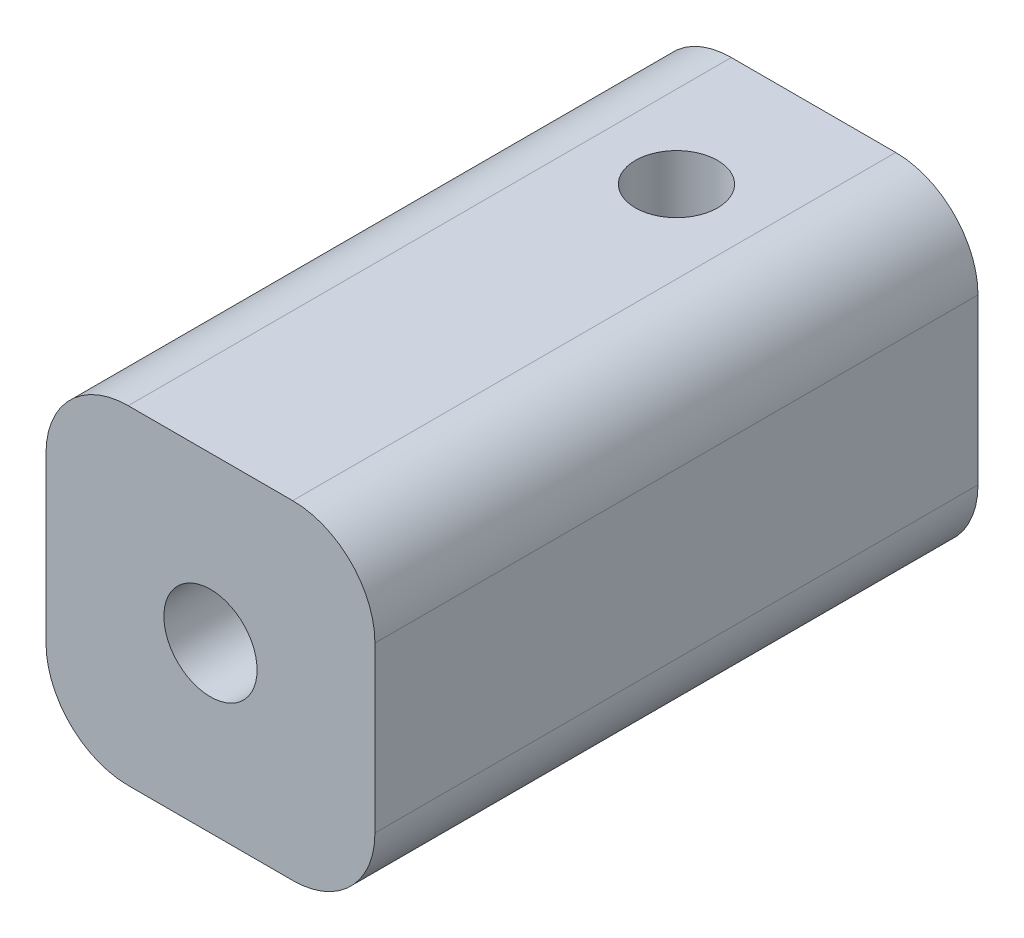
ISO-10303-21;
HEADER;
FILE_DESCRIPTION(('STEP AP214'),'2;1');
FILE_NAME('part.step','',(''),(''),'','','');
FILE_SCHEMA(('AUTOMOTIVE_DESIGN { 1 0 10303 214 1 1 1 1 }'));
ENDSEC;
DATA;
#1=APPLICATION_CONTEXT('core data for automotive mechanical design processes');
#2=APPLICATION_PROTOCOL_DEFINITION('international standard','automotive_design',2000,#1);
#3=PRODUCT_CONTEXT('',#1,'mechanical');
#4=PRODUCT('Part','Part','',(#3));
#5=PRODUCT_RELATED_PRODUCT_CATEGORY('part','',(#4));
#6=PRODUCT_DEFINITION_FORMATION('','',#4);
#7=PRODUCT_DEFINITION_CONTEXT('part definition',#1,'design');
#8=PRODUCT_DEFINITION('design','',#6,#7);
#9=PRODUCT_DEFINITION_SHAPE('','',#8);
#10=(LENGTH_UNIT() NAMED_UNIT(*) SI_UNIT(.MILLI.,.METRE.));
#11=(NAMED_UNIT(*) PLANE_ANGLE_UNIT() SI_UNIT($,.RADIAN.));
#12=(NAMED_UNIT(*) SI_UNIT($,.STERADIAN.) SOLID_ANGLE_UNIT());
#13=UNCERTAINTY_MEASURE_WITH_UNIT(LENGTH_MEASURE(1.E-05),#10,'distance_accuracy_value','');
#14=(GEOMETRIC_REPRESENTATION_CONTEXT(3) GLOBAL_UNCERTAINTY_ASSIGNED_CONTEXT((#13)) GLOBAL_UNIT_ASSIGNED_CONTEXT((#10,
#11,#12)) REPRESENTATION_CONTEXT('',''));
#15=CARTESIAN_POINT('',(0.,0.,0.));
#16=DIRECTION('',(0.,0.,1.));
#17=DIRECTION('',(1.,0.,0.));
#18=AXIS2_PLACEMENT_3D('',#15,#16,#17);
#19=CARTESIAN_POINT('',(0.,0.,22.));
#20=DIRECTION('',(0.,0.,1.));
#21=DIRECTION('',(1.,0.,0.));
#22=AXIS2_PLACEMENT_3D('',#19,#20,#21);
#23=PLANE('',#22);
#24=DIRECTION('',(0.,1.,0.));
#25=VECTOR('',#24,1.);
#26=CARTESIAN_POINT('',(19.4716981132076,5.20754716981132,22.));
#27=LINE('',#26,#25);
#28=CARTESIAN_POINT('',(19.4716981132076,-3.79245283018868,22.));
#29=VERTEX_POINT('',#28);
#30=CARTESIAN_POINT('',(19.4716981132076,2.20754716981132,22.));
#31=VERTEX_POINT('',#30);
#32=EDGE_CURVE('E228',#29,#31,#27,.T.);
#33=ORIENTED_EDGE('',*,*,#32,.T.);
#34=CARTESIAN_POINT('',(16.4716981132076,2.20754716981132,22.));
#35=DIRECTION('',(0.,0.,1.));
#36=DIRECTION('',(1.,0.,0.));
#37=AXIS2_PLACEMENT_3D('',#34,#35,#36);
#38=CIRCLE('',#37,3.);
#39=CARTESIAN_POINT('',(16.4716981132076,5.20754716981132,22.));
#40=VERTEX_POINT('',#39);
#41=EDGE_CURVE('E11',#31,#40,#38,.T.);
#42=ORIENTED_EDGE('',*,*,#41,.T.);
#43=DIRECTION('',(-1.,0.,0.));
#44=VECTOR('',#43,1.);
#45=CARTESIAN_POINT('',(7.47169811320756,5.20754716981132,22.));
#46=LINE('',#45,#44);
#47=CARTESIAN_POINT('',(10.4716981132076,5.20754716981132,22.));
#48=VERTEX_POINT('',#47);
#49=EDGE_CURVE('E116',#40,#48,#46,.T.);
#50=ORIENTED_EDGE('',*,*,#49,.T.);
#51=CARTESIAN_POINT('',(10.4716981132076,2.20754716981132,22.));
#52=DIRECTION('',(0.,0.,1.));
#53=DIRECTION('',(1.,0.,0.));
#54=AXIS2_PLACEMENT_3D('',#51,#52,#53);
#55=CIRCLE('',#54,3.);
#56=CARTESIAN_POINT('',(7.47169811320756,2.20754716981132,22.));
#57=VERTEX_POINT('',#56);
#58=EDGE_CURVE('E221',#48,#57,#55,.T.);
#59=ORIENTED_EDGE('',*,*,#58,.T.);
#60=DIRECTION('',(0.,-1.,0.));
#61=VECTOR('',#60,1.);
#62=CARTESIAN_POINT('',(7.47169811320756,5.20754716981132,22.));
#63=LINE('',#62,#61);
#64=CARTESIAN_POINT('',(7.47169811320756,-3.79245283018868,22.));
#65=VERTEX_POINT('',#64);
#66=EDGE_CURVE('E115',#57,#65,#63,.T.);
#67=ORIENTED_EDGE('',*,*,#66,.T.);
#68=CARTESIAN_POINT('',(10.4716981132076,-3.79245283018868,22.));
#69=DIRECTION('',(0.,0.,1.));
#70=DIRECTION('',(1.,0.,0.));
#71=AXIS2_PLACEMENT_3D('',#68,#69,#70);
#72=CIRCLE('',#71,3.);
#73=CARTESIAN_POINT('',(10.4716981132076,-6.79245283018868,22.));
#74=VERTEX_POINT('',#73);
#75=EDGE_CURVE('E213',#65,#74,#72,.T.);
#76=ORIENTED_EDGE('',*,*,#75,.T.);
#77=DIRECTION('',(1.,0.,0.));
#78=VECTOR('',#77,1.);
#79=CARTESIAN_POINT('',(7.47169811320756,-6.79245283018868,22.));
#80=LINE('',#79,#78);
#81=CARTESIAN_POINT('',(16.4716981132076,-6.79245283018868,22.));
#82=VERTEX_POINT('',#81);
#83=EDGE_CURVE('E229',#74,#82,#80,.T.);
#84=ORIENTED_EDGE('',*,*,#83,.T.);
#85=CARTESIAN_POINT('',(16.4716981132076,-3.79245283018868,22.));
#86=DIRECTION('',(0.,0.,1.));
#87=DIRECTION('',(1.,0.,0.));
#88=AXIS2_PLACEMENT_3D('',#85,#86,#87);
#89=CIRCLE('',#88,3.);
#90=EDGE_CURVE('E198',#82,#29,#89,.T.);
#91=ORIENTED_EDGE('',*,*,#90,.T.);
#92=EDGE_LOOP('',(#33,#42,#50,#59,#67,#76,#84,#91));
#93=FACE_BOUND('',#92,.T.);
#94=CARTESIAN_POINT('',(13.4716981132076,-0.792452830188677,22.));
#95=DIRECTION('',(0.,0.,1.));
#96=DIRECTION('',(1.,0.,0.));
#97=AXIS2_PLACEMENT_3D('',#94,#95,#96);
#98=CIRCLE('',#97,1.7);
#99=CARTESIAN_POINT('',(15.1716981132076,-0.792452830188677,22.));
#100=VERTEX_POINT('',#99);
#101=EDGE_CURVE('E123',#100,#100,#98,.T.);
#102=ORIENTED_EDGE('',*,*,#101,.F.);
#103=EDGE_LOOP('',(#102));
#104=FACE_BOUND('',#103,.T.);
#105=ADVANCED_FACE('F33',(#93,#104),#23,.T.);
#106=CARTESIAN_POINT('',(0.,0.,0.));
#107=DIRECTION('',(0.,0.,1.));
#108=DIRECTION('',(1.,0.,0.));
#109=AXIS2_PLACEMENT_3D('',#106,#107,#108);
#110=PLANE('',#109);
#111=DIRECTION('',(-1.,0.,0.));
#112=VECTOR('',#111,1.);
#113=CARTESIAN_POINT('',(7.47169811320756,5.20754716981132,0.));
#114=LINE('',#113,#112);
#115=CARTESIAN_POINT('',(16.4716981132076,5.20754716981132,0.));
#116=VERTEX_POINT('',#115);
#117=CARTESIAN_POINT('',(10.4716981132076,5.20754716981132,0.));
#118=VERTEX_POINT('',#117);
#119=EDGE_CURVE('E135',#116,#118,#114,.T.);
#120=ORIENTED_EDGE('',*,*,#119,.F.);
#121=CARTESIAN_POINT('',(16.4716981132076,2.20754716981132,0.));
#122=DIRECTION('',(0.,0.,1.));
#123=DIRECTION('',(1.,0.,0.));
#124=AXIS2_PLACEMENT_3D('',#121,#122,#123);
#125=CIRCLE('',#124,3.);
#126=CARTESIAN_POINT('',(19.4716981132076,2.20754716981132,0.));
#127=VERTEX_POINT('',#126);
#128=EDGE_CURVE('E55',#116,#127,#125,.F.);
#129=ORIENTED_EDGE('',*,*,#128,.T.);
#130=DIRECTION('',(0.,1.,0.));
#131=VECTOR('',#130,1.);
#132=CARTESIAN_POINT('',(19.4716981132076,5.20754716981132,0.));
#133=LINE('',#132,#131);
#134=CARTESIAN_POINT('',(19.4716981132076,-3.79245283018868,0.));
#135=VERTEX_POINT('',#134);
#136=EDGE_CURVE('E126',#135,#127,#133,.T.);
#137=ORIENTED_EDGE('',*,*,#136,.F.);
#138=CARTESIAN_POINT('',(16.4716981132076,-3.79245283018868,0.));
#139=DIRECTION('',(0.,0.,1.));
#140=DIRECTION('',(1.,0.,0.));
#141=AXIS2_PLACEMENT_3D('',#138,#139,#140);
#142=CIRCLE('',#141,3.);
#143=CARTESIAN_POINT('',(16.4716981132076,-6.79245283018868,0.));
#144=VERTEX_POINT('',#143);
#145=EDGE_CURVE('E207',#135,#144,#142,.F.);
#146=ORIENTED_EDGE('',*,*,#145,.T.);
#147=DIRECTION('',(1.,0.,0.));
#148=VECTOR('',#147,1.);
#149=CARTESIAN_POINT('',(7.47169811320756,-6.79245283018868,0.));
#150=LINE('',#149,#148);
#151=CARTESIAN_POINT('',(10.4716981132076,-6.79245283018868,0.));
#152=VERTEX_POINT('',#151);
#153=EDGE_CURVE('E122',#152,#144,#150,.T.);
#154=ORIENTED_EDGE('',*,*,#153,.F.);
#155=CARTESIAN_POINT('',(10.4716981132076,-3.79245283018868,0.));
#156=DIRECTION('',(0.,0.,1.));
#157=DIRECTION('',(1.,0.,0.));
#158=AXIS2_PLACEMENT_3D('',#155,#156,#157);
#159=CIRCLE('',#158,3.);
#160=CARTESIAN_POINT('',(7.47169811320756,-3.79245283018868,0.));
#161=VERTEX_POINT('',#160);
#162=EDGE_CURVE('E121',#152,#161,#159,.F.);
#163=ORIENTED_EDGE('',*,*,#162,.T.);
#164=DIRECTION('',(0.,-1.,0.));
#165=VECTOR('',#164,1.);
#166=CARTESIAN_POINT('',(7.47169811320756,5.20754716981132,0.));
#167=LINE('',#166,#165);
#168=CARTESIAN_POINT('',(7.47169811320756,2.20754716981132,0.));
#169=VERTEX_POINT('',#168);
#170=EDGE_CURVE('E112',#169,#161,#167,.T.);
#171=ORIENTED_EDGE('',*,*,#170,.F.);
#172=CARTESIAN_POINT('',(10.4716981132076,2.20754716981132,0.));
#173=DIRECTION('',(0.,0.,1.));
#174=DIRECTION('',(1.,0.,0.));
#175=AXIS2_PLACEMENT_3D('',#172,#173,#174);
#176=CIRCLE('',#175,3.);
#177=EDGE_CURVE('E99',#169,#118,#176,.F.);
#178=ORIENTED_EDGE('',*,*,#177,.T.);
#179=EDGE_LOOP('',(#120,#129,#137,#146,#154,#163,#171,#178));
#180=FACE_BOUND('',#179,.T.);
#181=CARTESIAN_POINT('',(13.4716981132076,-0.792452830188677,0.));
#182=DIRECTION('',(0.,0.,1.));
#183=DIRECTION('',(1.,0.,0.));
#184=AXIS2_PLACEMENT_3D('',#181,#182,#183);
#185=CIRCLE('',#184,1.7);
#186=CARTESIAN_POINT('',(15.1716981132076,-0.792452830188677,0.));
#187=VERTEX_POINT('',#186);
#188=EDGE_CURVE('E129',#187,#187,#185,.T.);
#189=ORIENTED_EDGE('',*,*,#188,.T.);
#190=EDGE_LOOP('',(#189));
#191=FACE_BOUND('',#190,.T.);
#192=ADVANCED_FACE('F118',(#180,#191),#110,.F.);
#193=CARTESIAN_POINT('',(7.47169811320756,5.20754716981132,22.));
#194=DIRECTION('',(1.,0.,0.));
#195=DIRECTION('',(0.,1.,0.));
#196=AXIS2_PLACEMENT_3D('',#193,#194,#195);
#197=PLANE('',#196);
#198=ORIENTED_EDGE('',*,*,#170,.T.);
#199=DIRECTION('',(0.,0.,-1.));
#200=VECTOR('',#199,1.);
#201=CARTESIAN_POINT('',(7.47169811320756,-3.79245283018868,22.));
#202=LINE('',#201,#200);
#203=EDGE_CURVE('E215',#161,#65,#202,.F.);
#204=ORIENTED_EDGE('',*,*,#203,.T.);
#205=ORIENTED_EDGE('',*,*,#66,.F.);
#206=DIRECTION('',(0.,0.,-1.));
#207=VECTOR('',#206,1.);
#208=CARTESIAN_POINT('',(7.47169811320756,2.20754716981132,22.));
#209=LINE('',#208,#207);
#210=EDGE_CURVE('E103',#57,#169,#209,.T.);
#211=ORIENTED_EDGE('',*,*,#210,.T.);
#212=EDGE_LOOP('',(#198,#204,#205,#211));
#213=FACE_BOUND('',#212,.T.);
#214=ADVANCED_FACE('F111',(#213),#197,.F.);
#215=CARTESIAN_POINT('',(7.47169811320756,-6.79245283018868,22.));
#216=DIRECTION('',(0.,1.,0.));
#217=DIRECTION('',(0.,0.,1.));
#218=AXIS2_PLACEMENT_3D('',#215,#216,#217);
#219=PLANE('',#218);
#220=CARTESIAN_POINT('',(13.4716981132076,-6.79245283018868,5.));
#221=DIRECTION('',(0.,1.,0.));
#222=DIRECTION('',(0.,0.,1.));
#223=AXIS2_PLACEMENT_3D('',#220,#221,#222);
#224=CIRCLE('',#223,1.5);
#225=CARTESIAN_POINT('',(13.4716981132076,-6.79245283018868,6.5));
#226=VERTEX_POINT('',#225);
#227=EDGE_CURVE('E234',#226,#226,#224,.T.);
#228=ORIENTED_EDGE('',*,*,#227,.T.);
#229=EDGE_LOOP('',(#228));
#230=FACE_BOUND('',#229,.T.);
#231=ORIENTED_EDGE('',*,*,#153,.T.);
#232=DIRECTION('',(0.,0.,-1.));
#233=VECTOR('',#232,1.);
#234=CARTESIAN_POINT('',(16.4716981132076,-6.79245283018868,22.));
#235=LINE('',#234,#233);
#236=EDGE_CURVE('E199',#144,#82,#235,.F.);
#237=ORIENTED_EDGE('',*,*,#236,.T.);
#238=ORIENTED_EDGE('',*,*,#83,.F.);
#239=DIRECTION('',(0.,0.,-1.));
#240=VECTOR('',#239,1.);
#241=CARTESIAN_POINT('',(10.4716981132076,-6.79245283018868,22.));
#242=LINE('',#241,#240);
#243=EDGE_CURVE('E218',#74,#152,#242,.T.);
#244=ORIENTED_EDGE('',*,*,#243,.T.);
#245=EDGE_LOOP('',(#231,#237,#238,#244));
#246=FACE_BOUND('',#245,.T.);
#247=ADVANCED_FACE('F180',(#230,#246),#219,.F.);
#248=CARTESIAN_POINT('',(19.4716981132076,5.20754716981132,22.));
#249=DIRECTION('',(-1.,0.,0.));
#250=DIRECTION('',(0.,0.,1.));
#251=AXIS2_PLACEMENT_3D('',#248,#249,#250);
#252=PLANE('',#251);
#253=ORIENTED_EDGE('',*,*,#136,.T.);
#254=DIRECTION('',(0.,0.,-1.));
#255=VECTOR('',#254,1.);
#256=CARTESIAN_POINT('',(19.4716981132076,2.20754716981132,22.));
#257=LINE('',#256,#255);
#258=EDGE_CURVE('E41',#127,#31,#257,.F.);
#259=ORIENTED_EDGE('',*,*,#258,.T.);
#260=ORIENTED_EDGE('',*,*,#32,.F.);
#261=DIRECTION('',(0.,0.,-1.));
#262=VECTOR('',#261,1.);
#263=CARTESIAN_POINT('',(19.4716981132076,-3.79245283018868,22.));
#264=LINE('',#263,#262);
#265=EDGE_CURVE('E201',#29,#135,#264,.T.);
#266=ORIENTED_EDGE('',*,*,#265,.T.);
#267=EDGE_LOOP('',(#253,#259,#260,#266));
#268=FACE_BOUND('',#267,.T.);
#269=ADVANCED_FACE('F176',(#268),#252,.F.);
#270=CARTESIAN_POINT('',(7.47169811320756,5.20754716981132,22.));
#271=DIRECTION('',(0.,-1.,0.));
#272=DIRECTION('',(0.,0.,-1.));
#273=AXIS2_PLACEMENT_3D('',#270,#271,#272);
#274=PLANE('',#273);
#275=CARTESIAN_POINT('',(13.4716981132076,5.20754716981132,5.));
#276=DIRECTION('',(0.,-1.,0.));
#277=DIRECTION('',(0.,0.,-1.));
#278=AXIS2_PLACEMENT_3D('',#275,#276,#277);
#279=CIRCLE('',#278,1.5);
#280=CARTESIAN_POINT('',(13.4716981132076,5.20754716981132,3.5));
#281=VERTEX_POINT('',#280);
#282=EDGE_CURVE('E238',#281,#281,#279,.T.);
#283=ORIENTED_EDGE('',*,*,#282,.T.);
#284=EDGE_LOOP('',(#283));
#285=FACE_BOUND('',#284,.T.);
#286=ORIENTED_EDGE('',*,*,#49,.F.);
#287=DIRECTION('',(0.,0.,-1.));
#288=VECTOR('',#287,1.);
#289=CARTESIAN_POINT('',(16.4716981132076,5.20754716981132,22.));
#290=LINE('',#289,#288);
#291=EDGE_CURVE('E203',#40,#116,#290,.T.);
#292=ORIENTED_EDGE('',*,*,#291,.T.);
#293=ORIENTED_EDGE('',*,*,#119,.T.);
#294=DIRECTION('',(0.,0.,-1.));
#295=VECTOR('',#294,1.);
#296=CARTESIAN_POINT('',(10.4716981132076,5.20754716981132,22.));
#297=LINE('',#296,#295);
#298=EDGE_CURVE('E105',#118,#48,#297,.F.);
#299=ORIENTED_EDGE('',*,*,#298,.T.);
#300=EDGE_LOOP('',(#286,#292,#293,#299));
#301=FACE_BOUND('',#300,.T.);
#302=ADVANCED_FACE('F173',(#285,#301),#274,.F.);
#303=CARTESIAN_POINT('',(13.4716981132076,-0.792452830188677,22.));
#304=DIRECTION('',(0.,0.,-1.));
#305=DIRECTION('',(-1.,0.,0.));
#306=AXIS2_PLACEMENT_3D('',#303,#304,#305);
#307=CYLINDRICAL_SURFACE('',#306,1.7);
#308=CARTESIAN_POINT('',(13.4716981132076,-2.49245283018868,6.5));
#309=CARTESIAN_POINT('',(13.5417068523817,-2.49245160382284,6.49999875632911));
#310=CARTESIAN_POINT('',(13.6117240091962,-2.48809234885185,6.49506353629652));
#311=CARTESIAN_POINT('',(13.7493916664549,-2.47105551877606,6.47571253606531));
#312=CARTESIAN_POINT('',(13.8170407901794,-2.4583731867337,6.46129133427649));
#313=CARTESIAN_POINT('',(13.9476580314437,-2.42584484929937,6.42409636130792));
#314=CARTESIAN_POINT('',(14.0106521463238,-2.40604293912569,6.4013739898979));
#315=CARTESIAN_POINT('',(14.1312879904491,-2.36060634738604,6.34880645897445));
#316=CARTESIAN_POINT('',(14.1889275120942,-2.33496927498646,6.31895837960802));
#317=CARTESIAN_POINT('',(14.3196731026762,-2.26833079677455,6.24048600251293));
#318=CARTESIAN_POINT('',(14.3900424262516,-2.22523697106201,6.1890791364719));
#319=CARTESIAN_POINT('',(14.5191759551605,-2.13375293395824,6.07709460275428));
#320=CARTESIAN_POINT('',(14.5779095699447,-2.08534926804836,6.0164934819822));
#321=CARTESIAN_POINT('',(14.6850976912884,-1.98539745635565,5.88598086187635));
#322=CARTESIAN_POINT('',(14.7332940807101,-1.93380328340412,5.8158920386535));
#323=CARTESIAN_POINT('',(14.7965762952045,-1.85818547468603,5.70463240529521));
#324=CARTESIAN_POINT('',(14.8161601835513,-1.83328803956798,5.66654694122864));
#325=CARTESIAN_POINT('',(14.8522697852715,-1.78488865994508,5.58812078557867));
#326=CARTESIAN_POINT('',(14.8687977297379,-1.76138570593483,5.54778176751936));
#327=CARTESIAN_POINT('',(14.898917936789,-1.71645945096385,5.46376184901165));
#328=CARTESIAN_POINT('',(14.9124469760411,-1.69508538320407,5.42003127289049));
#329=CARTESIAN_POINT('',(14.9357525759,-1.65677178716977,5.32971379216853));
#330=CARTESIAN_POINT('',(14.9455355185664,-1.63982473258823,5.28313190372115));
#331=CARTESIAN_POINT('',(14.9595334765371,-1.61496088787423,5.19494384550629));
#332=CARTESIAN_POINT('',(14.9643895533706,-1.60603215823256,5.15373665618565));
#333=CARTESIAN_POINT('',(14.9706359367736,-1.59447070834894,5.07021507091241));
#334=CARTESIAN_POINT('',(14.9720327786774,-1.59182611622936,5.02790291564666));
#335=CARTESIAN_POINT('',(14.9712260427683,-1.5933371509559,4.94338442721651));
#336=CARTESIAN_POINT('',(14.9690175662222,-1.59750203019522,4.90117831620491));
#337=CARTESIAN_POINT('',(14.9612156919552,-1.6118433897291,4.81810015365596));
#338=CARTESIAN_POINT('',(14.9556152542727,-1.6220323719033,4.77723106353436));
#339=CARTESIAN_POINT('',(14.9374714736663,-1.65384388950303,4.67518947427655));
#340=CARTESIAN_POINT('',(14.9227973362636,-1.67867390036954,4.61542856564467));
#341=CARTESIAN_POINT('',(14.8873918290115,-1.7342083165645,4.50054743905421));
#342=CARTESIAN_POINT('',(14.8666349693485,-1.76493725067712,4.44544803355374));
#343=CARTESIAN_POINT('',(14.8233893926452,-1.82398239010228,4.34785251950414));
#344=CARTESIAN_POINT('',(14.8017078110688,-1.8518991560425,4.30474962626569));
#345=CARTESIAN_POINT('',(14.7545709476081,-1.90851676333517,4.22119308912391));
#346=CARTESIAN_POINT('',(14.7291133376558,-1.93721807942475,4.1807411019496));
#347=CARTESIAN_POINT('',(14.6471455004012,-2.02312823852826,4.06328005061246));
#348=CARTESIAN_POINT('',(14.5849666802605,-2.08025045620948,3.99000137659436));
#349=CARTESIAN_POINT('',(14.4600071599469,-2.17742593711155,3.86901815082183));
#350=CARTESIAN_POINT('',(14.4001055321063,-2.21854184026076,3.81917669513383));
#351=CARTESIAN_POINT('',(14.270742550944,-2.29482932079735,3.72808806376743));
#352=CARTESIAN_POINT('',(14.2012990070396,-2.3300117064453,3.68682522897865));
#353=CARTESIAN_POINT('',(14.0683077013337,-2.38561574725722,3.62218341766973));
#354=CARTESIAN_POINT('',(14.0063474861163,-2.4075818965859,3.59687889007232));
#355=CARTESIAN_POINT('',(13.8777147346392,-2.44460818672002,3.55441131436544));
#356=CARTESIAN_POINT('',(13.81104499724,-2.45967239014345,3.53724347663843));
#357=CARTESIAN_POINT('',(13.6742435000289,-2.48177209411223,3.51210356533336));
#358=CARTESIAN_POINT('',(13.6040936353255,-2.48875970174551,3.50418634343732));
#359=CARTESIAN_POINT('',(13.4630607344038,-2.49389284823341,3.49836742260239));
#360=CARTESIAN_POINT('',(13.3921779394199,-2.49204120943077,3.50046252676047));
#361=CARTESIAN_POINT('',(13.2589194051943,-2.48028300732387,3.51380393336152));
#362=CARTESIAN_POINT('',(13.1963789664015,-2.47116466759814,3.52415481345262));
#363=CARTESIAN_POINT('',(13.0743091511263,-2.44652718476717,3.55224059608348));
#364=CARTESIAN_POINT('',(13.0147804713038,-2.43100656826114,3.56997719836013));
#365=CARTESIAN_POINT('',(12.8966832502851,-2.39351738268306,3.61308704826001));
#366=CARTESIAN_POINT('',(12.8383489006702,-2.37124030076038,3.63882764801381));
#367=CARTESIAN_POINT('',(12.7270147800305,-2.32188451310439,3.69639725694487));
#368=CARTESIAN_POINT('',(12.674016342775,-2.29480461150217,3.7282277826274));
#369=CARTESIAN_POINT('',(12.5478403608558,-2.22219645539291,3.81468440468026));
#370=CARTESIAN_POINT('',(12.4782709294899,-2.1743341868133,3.87262422850811));
#371=CARTESIAN_POINT('',(12.3517982476174,-2.07399949975199,3.9980920515021));
#372=CARTESIAN_POINT('',(12.2949512739735,-2.02150797623393,4.06566056876975));
#373=CARTESIAN_POINT('',(12.2186524133138,-1.94191973686999,4.17423647049404));
#374=CARTESIAN_POINT('',(12.1944929583613,-1.91493584994126,4.21210709985837));
#375=CARTESIAN_POINT('',(12.1494828304579,-1.86154764091626,4.29022357973887));
#376=CARTESIAN_POINT('',(12.1286344481035,-1.83514373083497,4.33047104837126));
#377=CARTESIAN_POINT('',(12.0904425144918,-1.78399018070203,4.41331058475652));
#378=CARTESIAN_POINT('',(12.0730830959125,-1.7592334104273,4.45589086291156));
#379=CARTESIAN_POINT('',(12.0419863923057,-1.71261895620732,4.54382524297806));
#380=CARTESIAN_POINT('',(12.0282429868391,-1.69075640510762,4.58917449569872));
#381=CARTESIAN_POINT('',(12.0062589012607,-1.65435980953767,4.67708758142461));
#382=CARTESIAN_POINT('',(11.99754399003,-1.63925028744669,4.71928629869572));
#383=CARTESIAN_POINT('',(11.983682053298,-1.61465141413093,4.80579490787401));
#384=CARTESIAN_POINT('',(11.9785238781479,-1.60514451356622,4.85009773270314));
#385=CARTESIAN_POINT('',(11.9721880358144,-1.59340322872894,4.94052064412547));
#386=CARTESIAN_POINT('',(11.9710560752906,-1.59125236259332,4.98665562233413));
#387=CARTESIAN_POINT('',(11.9730483716819,-1.59498050226204,5.07852745353656));
#388=CARTESIAN_POINT('',(11.9761772405469,-1.6008682090887,5.12426382111635));
#389=CARTESIAN_POINT('',(11.9872948628408,-1.62112439554374,5.22233122562971));
#390=CARTESIAN_POINT('',(11.9960938418639,-1.63689133510665,5.27426475520967));
#391=CARTESIAN_POINT('',(12.0183605921557,-1.6746584521294,5.3748115944622));
#392=CARTESIAN_POINT('',(12.0318459925729,-1.69668210787332,5.42341152543482));
#393=CARTESIAN_POINT('',(12.0612122771967,-1.74175589826124,5.51232484075526));
#394=CARTESIAN_POINT('',(12.0766796064369,-1.76444095812932,5.55296731425224));
#395=CARTESIAN_POINT('',(12.1106494893997,-1.81146796393036,5.63197739932792));
#396=CARTESIAN_POINT('',(12.1291543137685,-1.83581114134522,5.67034327962789));
#397=CARTESIAN_POINT('',(12.1891083502782,-1.9100358685172,5.78240938602268));
#398=CARTESIAN_POINT('',(12.2349783051273,-1.96108164984026,5.85302271254407));
#399=CARTESIAN_POINT('',(12.3420573337923,-2.06521056506994,5.9909869565072));
#400=CARTESIAN_POINT('',(12.4041184246175,-2.11818443773953,6.05775899935043));
#401=CARTESIAN_POINT('',(12.5419400352056,-2.21820119099918,6.18068735391677));
#402=CARTESIAN_POINT('',(12.6176628330357,-2.26525981209981,6.23687204666575));
#403=CARTESIAN_POINT('',(12.7578010928161,-2.3366551552924,6.32094198820479));
#404=CARTESIAN_POINT('',(12.8188345308826,-2.36357971689967,6.35226685817922));
#405=CARTESIAN_POINT('',(12.9467982461465,-2.41082014994477,6.40687672089125));
#406=CARTESIAN_POINT('',(13.0137221273223,-2.43114307981661,6.43017030229327));
#407=CARTESIAN_POINT('',(13.1451705159853,-2.4620255804914,6.46544794661415));
#408=CARTESIAN_POINT('',(13.2092709043495,-2.47335555720916,6.47832687379487));
#409=CARTESIAN_POINT('',(13.33947816833,-2.48856855554964,6.49560211448821));
#410=CARTESIAN_POINT('',(13.4055843872454,-2.4924539883243,6.50000117447789));
#411=CARTESIAN_POINT('',(13.4716981132076,-2.49245283018868,6.5));
#412=B_SPLINE_CURVE_WITH_KNOTS('',3,(#308,#309,#310,#311,#312,#313,#314,#315,#316,#317,#318,
#319,#320,#321,#322,#323,#324,#325,#326,#327,#328,#329,#330,#331,#332,#333,#334,#335,#336,#337,
#338,#339,#340,#341,#342,#343,#344,#345,#346,#347,#348,#349,#350,#351,#352,#353,#354,#355,#356,
#357,#358,#359,#360,#361,#362,#363,#364,#365,#366,#367,#368,#369,#370,#371,#372,#373,#374,#375,
#376,#377,#378,#379,#380,#381,#382,#383,#384,#385,#386,#387,#388,#389,#390,#391,#392,#393,#394,
#395,#396,#397,#398,#399,#400,#401,#402,#403,#404,#405,#406,#407,#408,#409,#410,#411),
.UNSPECIFIED.,.T.,.F.,(4,2,2,2,2,2,2,2,2,2,2,2,2,2,2,2,2,2,2,2,2,2,2,2,2,2,2,2,2,2,2,2,2,2,2,2,
2,2,2,2,2,2,2,2,2,2,2,2,2,2,2,4),(0.,0.209746025645155,0.419612033200701,0.628200011716771,
0.836873609063467,1.12694213140684,1.4177634154585,1.71506291983233,1.86355289337684,
2.0119340250927,2.16319585157903,2.31419882111561,2.44100184214456,2.56756511810675,
2.69430050532435,2.82129983553475,3.01924364988847,3.21802911341303,3.38504066109738,
3.55215560921966,3.88576342288103,4.14918146353635,4.41211436467847,4.62259354187402,
4.83294866730979,5.044544866971,5.25607350917081,5.44734857019671,5.63866767527278,
5.84054265762846,6.04246797620853,6.34805445353694,6.65496706692521,6.81204750386119,
6.96923613992702,7.12569286835261,7.28188305034769,7.41846366638829,7.5546141591455,
7.69230542118263,7.8301458396726,7.99416841662761,8.15881480671427,8.30575549755068,
8.45280653675967,8.74710503866704,9.06210498976215,9.37624813350882,9.59652516325777,
9.81656589263172,10.0147066524562,10.2127832272487),.UNSPECIFIED.);
#413=CARTESIAN_POINT('',(13.4716981132076,-2.49245283018868,6.5));
#414=VERTEX_POINT('',#413);
#415=EDGE_CURVE('E144',#414,#414,#412,.T.);
#416=ORIENTED_EDGE('',*,*,#415,.F.);
#417=EDGE_LOOP('',(#416));
#418=FACE_BOUND('',#417,.T.);
#419=CARTESIAN_POINT('',(13.4716981132076,0.907547169811322,6.5));
#420=CARTESIAN_POINT('',(13.4016893740334,0.907545943445485,6.49999875632912));
#421=CARTESIAN_POINT('',(13.3316722172189,0.903186688474496,6.49506353629652));
#422=CARTESIAN_POINT('',(13.1940045599602,0.886149858398707,6.47571253606531));
#423=CARTESIAN_POINT('',(13.1263554362357,0.873467526356341,6.46129133427649));
#424=CARTESIAN_POINT('',(12.9957381949714,0.840939188922016,6.42409636130792));
#425=CARTESIAN_POINT('',(12.9327440800913,0.821137278748339,6.4013739898979));
#426=CARTESIAN_POINT('',(12.812108235966,0.775700687008689,6.34880645897445));
#427=CARTESIAN_POINT('',(12.754468714321,0.750063614609101,6.31895837960802));
#428=CARTESIAN_POINT('',(12.6237231237389,0.683425136397198,6.24048600251293));
#429=CARTESIAN_POINT('',(12.5533538001635,0.640331310684653,6.1890791364719));
#430=CARTESIAN_POINT('',(12.4242202712546,0.548847273580885,6.07709460275428));
#431=CARTESIAN_POINT('',(12.3654866564704,0.500443607671008,6.0164934819822));
#432=CARTESIAN_POINT('',(12.2582985351267,0.400491795978294,5.88598086187635));
#433=CARTESIAN_POINT('',(12.210102145705,0.348897623026763,5.8158920386535));
#434=CARTESIAN_POINT('',(12.1468199312106,0.273279814308675,5.70463240529522));
#435=CARTESIAN_POINT('',(12.1272360428638,0.248382379190624,5.66654694122864));
#436=CARTESIAN_POINT('',(12.0911264411436,0.199982999567728,5.58812078557867));
#437=CARTESIAN_POINT('',(12.0745984966772,0.176480045557479,5.54778176751936));
#438=CARTESIAN_POINT('',(12.0444782896261,0.131553790586491,5.46376184901165));
#439=CARTESIAN_POINT('',(12.030949250374,0.110179722826718,5.42003127289049));
#440=CARTESIAN_POINT('',(12.0076436505151,0.0718661267924166,5.32971379216853));
#441=CARTESIAN_POINT('',(11.9978607078487,0.054919072210879,5.28313190372115));
#442=CARTESIAN_POINT('',(11.9838627498781,0.0300552274968779,5.19494384550629));
#443=CARTESIAN_POINT('',(11.9790066730445,0.0211264978552085,5.15373665618565));
#444=CARTESIAN_POINT('',(11.9727602896416,0.00956504797158851,5.07021507091241));
#445=CARTESIAN_POINT('',(11.9713634477377,0.00692045585200277,5.02790291564666));
#446=CARTESIAN_POINT('',(11.9721701836468,0.00843149057854573,4.94338442721652));
#447=CARTESIAN_POINT('',(11.9743786601929,0.0125963698178692,4.90117831620491));
#448=CARTESIAN_POINT('',(11.9821805344599,0.0269377293517454,4.81810015365597));
#449=CARTESIAN_POINT('',(11.9877809721424,0.0371267115259417,4.77723106353436));
#450=CARTESIAN_POINT('',(12.0059247527488,0.0689382291256747,4.67518947427656));
#451=CARTESIAN_POINT('',(12.0205988901515,0.0937682399921787,4.61542856564467));
#452=CARTESIAN_POINT('',(12.0560043974036,0.149302656187145,4.50054743905421));
#453=CARTESIAN_POINT('',(12.0767612570666,0.180031590299763,4.44544803355375));
#454=CARTESIAN_POINT('',(12.1200068337699,0.239076729724926,4.34785251950415));
#455=CARTESIAN_POINT('',(12.1416884153463,0.266993495665139,4.30474962626569));
#456=CARTESIAN_POINT('',(12.188825278807,0.323611102957811,4.22119308912391));
#457=CARTESIAN_POINT('',(12.2142828887593,0.352312419047391,4.18074110194961));
#458=CARTESIAN_POINT('',(12.2962507260139,0.438222578150903,4.06328005061246));
#459=CARTESIAN_POINT('',(12.3584295461546,0.495344795832122,3.99000137659436));
#460=CARTESIAN_POINT('',(12.4833890664682,0.592520276734191,3.86901815082183));
#461=CARTESIAN_POINT('',(12.5432906943088,0.6336361798834,3.81917669513384));
#462=CARTESIAN_POINT('',(12.6726536754711,0.709923660419996,3.72808806376744));
#463=CARTESIAN_POINT('',(12.7420972193755,0.745106046067945,3.68682522897865));
#464=CARTESIAN_POINT('',(12.8750885250814,0.800710086879864,3.62218341766973));
#465=CARTESIAN_POINT('',(12.9370487402988,0.822676236208549,3.59687889007233));
#466=CARTESIAN_POINT('',(13.0656814917759,0.859702526342669,3.55441131436544));
#467=CARTESIAN_POINT('',(13.1323512291751,0.874766729766092,3.53724347663843));
#468=CARTESIAN_POINT('',(13.2691527263863,0.896866433734873,3.51210356533336));
#469=CARTESIAN_POINT('',(13.3393025910896,0.90385404136816,3.50418634343732));
#470=CARTESIAN_POINT('',(13.4803354920113,0.908987187856053,3.49836742260239));
#471=CARTESIAN_POINT('',(13.5512182869952,0.907135549053415,3.50046252676047));
#472=CARTESIAN_POINT('',(13.6844768212208,0.895377346946518,3.51380393336152));
#473=CARTESIAN_POINT('',(13.7470172600136,0.886259007220782,3.52415481345262));
#474=CARTESIAN_POINT('',(13.8690870752888,0.861621524389816,3.55224059608348));
#475=CARTESIAN_POINT('',(13.9286157551113,0.846100907883783,3.56997719836013));
#476=CARTESIAN_POINT('',(14.04671297613,0.808611722305702,3.61308704826001));
#477=CARTESIAN_POINT('',(14.1050473257449,0.786334640383025,3.6388276480138));
#478=CARTESIAN_POINT('',(14.2163814463847,0.736978852727033,3.69639725694487));
#479=CARTESIAN_POINT('',(14.2693798836401,0.709898951124816,3.7282277826274));
#480=CARTESIAN_POINT('',(14.3955558655593,0.637290795015562,3.81468440468026));
#481=CARTESIAN_POINT('',(14.4651252969252,0.58942852643595,3.8726242285081));
#482=CARTESIAN_POINT('',(14.5915979787977,0.489093839374636,3.9980920515021));
#483=CARTESIAN_POINT('',(14.6484449524416,0.436602315856581,4.06566056876974));
#484=CARTESIAN_POINT('',(14.7247438131014,0.357014076492642,4.17423647049404));
#485=CARTESIAN_POINT('',(14.7489032680538,0.330030189563912,4.21210709985836));
#486=CARTESIAN_POINT('',(14.7939133959572,0.276641980538908,4.29022357973887));
#487=CARTESIAN_POINT('',(14.8147617783116,0.250238070457617,4.33047104837125));
#488=CARTESIAN_POINT('',(14.8529537119233,0.199084520324677,4.41331058475651));
#489=CARTESIAN_POINT('',(14.8703131305026,0.174327750049947,4.45589086291156));
#490=CARTESIAN_POINT('',(14.9014098341094,0.127713295829973,4.54382524297805));
#491=CARTESIAN_POINT('',(14.915153239576,0.105850744730269,4.58917449569872));
#492=CARTESIAN_POINT('',(14.9371373251544,0.0694541491603227,4.6770875814246));
#493=CARTESIAN_POINT('',(14.9458522363851,0.0543446270693424,4.71928629869571));
#494=CARTESIAN_POINT('',(14.9597141731171,0.0297457537535783,4.80579490787401));
#495=CARTESIAN_POINT('',(14.9648723482672,0.0202388531888673,4.85009773270313));
#496=CARTESIAN_POINT('',(14.9712081906007,0.00849756835159014,4.94052064412546));
#497=CARTESIAN_POINT('',(14.9723401511245,0.00634670221596684,4.98665562233412));
#498=CARTESIAN_POINT('',(14.9703478547332,0.0100748418846819,5.07852745353656));
#499=CARTESIAN_POINT('',(14.9672189858682,0.0159625487113411,5.12426382111634));
#500=CARTESIAN_POINT('',(14.9561013635743,0.0362187351663817,5.22233122562971));
#501=CARTESIAN_POINT('',(14.9473023845512,0.051985674729296,5.27426475520967));
#502=CARTESIAN_POINT('',(14.9250356342594,0.0897527917520395,5.3748115944622));
#503=CARTESIAN_POINT('',(14.9115502338422,0.111776447495965,5.42341152543481));
#504=CARTESIAN_POINT('',(14.8821839492184,0.156850237883883,5.51232484075526));
#505=CARTESIAN_POINT('',(14.8667166199782,0.179535297751964,5.55296731425224));
#506=CARTESIAN_POINT('',(14.8327467370154,0.226562303552999,5.63197739932792));
#507=CARTESIAN_POINT('',(14.8142419126466,0.250905480967861,5.67034327962789));
#508=CARTESIAN_POINT('',(14.7542878761369,0.325130208139843,5.78240938602267));
#509=CARTESIAN_POINT('',(14.7084179212878,0.376175989462899,5.85302271254406));
#510=CARTESIAN_POINT('',(14.6013388926229,0.480304904692583,5.99098695650719));
#511=CARTESIAN_POINT('',(14.5392778017977,0.533278777362174,6.05775899935042));
#512=CARTESIAN_POINT('',(14.4014561912095,0.63329553062182,6.18068735391676));
#513=CARTESIAN_POINT('',(14.3257333933794,0.680354151722453,6.23687204666574));
#514=CARTESIAN_POINT('',(14.185595133599,0.751749494915039,6.32094198820479));
#515=CARTESIAN_POINT('',(14.1245616955325,0.778674056522313,6.35226685817921));
#516=CARTESIAN_POINT('',(13.9965979802687,0.825914489567417,6.40687672089124));
#517=CARTESIAN_POINT('',(13.9296740990928,0.846237419439251,6.43017030229326));
#518=CARTESIAN_POINT('',(13.7982257104298,0.877119920114041,6.46544794661415));
#519=CARTESIAN_POINT('',(13.7341253220657,0.888449896831802,6.47832687379487));
#520=CARTESIAN_POINT('',(13.6039180580852,0.903662895172282,6.49560211448821));
#521=CARTESIAN_POINT('',(13.5378118391697,0.907548327946948,6.50000117447789));
#522=CARTESIAN_POINT('',(13.4716981132076,0.907547169811322,6.5));
#523=B_SPLINE_CURVE_WITH_KNOTS('',3,(#419,#420,#421,#422,#423,#424,#425,#426,#427,#428,#429,
#430,#431,#432,#433,#434,#435,#436,#437,#438,#439,#440,#441,#442,#443,#444,#445,#446,#447,#448,
#449,#450,#451,#452,#453,#454,#455,#456,#457,#458,#459,#460,#461,#462,#463,#464,#465,#466,#467,
#468,#469,#470,#471,#472,#473,#474,#475,#476,#477,#478,#479,#480,#481,#482,#483,#484,#485,#486,
#487,#488,#489,#490,#491,#492,#493,#494,#495,#496,#497,#498,#499,#500,#501,#502,#503,#504,#505,
#506,#507,#508,#509,#510,#511,#512,#513,#514,#515,#516,#517,#518,#519,#520,#521,#522),
.UNSPECIFIED.,.T.,.F.,(4,2,2,2,2,2,2,2,2,2,2,2,2,2,2,2,2,2,2,2,2,2,2,2,2,2,2,2,2,2,2,2,2,2,2,2,
2,2,2,2,2,2,2,2,2,2,2,2,2,2,2,4),(0.,0.209746025645155,0.419612033200701,0.628200011716771,
0.836873609063468,1.12694213140684,1.4177634154585,1.71506291983233,1.86355289337683,
2.0119340250927,2.16319585157903,2.31419882111561,2.44100184214455,2.56756511810674,
2.69430050532435,2.82129983553475,3.01924364988847,3.21802911341302,3.38504066109738,
3.55215560921965,3.88576342288102,4.14918146353634,4.41211436467847,4.62259354187402,
4.83294866730979,5.044544866971,5.25607350917081,5.44734857019671,5.63866767527277,
5.84054265762846,6.04246797620853,6.34805445353693,6.6549670669252,6.81204750386119,
6.96923613992701,7.1256928683526,7.28188305034768,7.41846366638829,7.5546141591455,
7.69230542118263,7.8301458396726,7.9941684166276,8.15881480671426,8.30575549755068,
8.45280653675966,8.74710503866704,9.06210498976214,9.3762481335088,9.59652516325776,
9.81656589263171,10.0147066524562,10.2127832272487),.UNSPECIFIED.);
#524=CARTESIAN_POINT('',(13.4716981132076,0.907547169811322,6.5));
#525=VERTEX_POINT('',#524);
#526=EDGE_CURVE('E137',#525,#525,#523,.T.);
#527=ORIENTED_EDGE('',*,*,#526,.F.);
#528=EDGE_LOOP('',(#527));
#529=FACE_BOUND('',#528,.T.);
#530=ORIENTED_EDGE('',*,*,#101,.T.);
#531=EDGE_LOOP('',(#530));
#532=FACE_BOUND('',#531,.T.);
#533=ORIENTED_EDGE('',*,*,#188,.F.);
#534=EDGE_LOOP('',(#533));
#535=FACE_BOUND('',#534,.T.);
#536=ADVANCED_FACE('F147',(#418,#529,#532,#535),#307,.F.);
#537=CARTESIAN_POINT('',(13.4716981132076,-10.,5.));
#538=DIRECTION('',(0.,1.,0.));
#539=DIRECTION('',(0.,0.,1.));
#540=AXIS2_PLACEMENT_3D('',#537,#538,#539);
#541=CYLINDRICAL_SURFACE('',#540,1.5);
#542=ORIENTED_EDGE('',*,*,#526,.T.);
#543=EDGE_LOOP('',(#542));
#544=FACE_BOUND('',#543,.T.);
#545=ORIENTED_EDGE('',*,*,#282,.F.);
#546=EDGE_LOOP('',(#545));
#547=FACE_BOUND('',#546,.T.);
#548=ADVANCED_FACE('F153',(#544,#547),#541,.F.);
#549=ORIENTED_EDGE('',*,*,#415,.T.);
#550=EDGE_LOOP('',(#549));
#551=FACE_BOUND('',#550,.T.);
#552=ORIENTED_EDGE('',*,*,#227,.F.);
#553=EDGE_LOOP('',(#552));
#554=FACE_BOUND('',#553,.T.);
#555=ADVANCED_FACE('F150',(#551,#554),#541,.F.);
#556=CARTESIAN_POINT('',(10.4716981132076,2.20754716981132,22.));
#557=DIRECTION('',(0.,0.,-1.));
#558=DIRECTION('',(-1.,0.,0.));
#559=AXIS2_PLACEMENT_3D('',#556,#557,#558);
#560=CYLINDRICAL_SURFACE('',#559,3.);
#561=ORIENTED_EDGE('',*,*,#58,.F.);
#562=ORIENTED_EDGE('',*,*,#298,.F.);
#563=ORIENTED_EDGE('',*,*,#177,.F.);
#564=ORIENTED_EDGE('',*,*,#210,.F.);
#565=EDGE_LOOP('',(#561,#562,#563,#564));
#566=FACE_BOUND('',#565,.T.);
#567=ADVANCED_FACE('F102',(#566),#560,.T.);
#568=CARTESIAN_POINT('',(10.4716981132076,-3.79245283018868,22.));
#569=DIRECTION('',(0.,0.,-1.));
#570=DIRECTION('',(-1.,0.,0.));
#571=AXIS2_PLACEMENT_3D('',#568,#569,#570);
#572=CYLINDRICAL_SURFACE('',#571,3.);
#573=ORIENTED_EDGE('',*,*,#75,.F.);
#574=ORIENTED_EDGE('',*,*,#203,.F.);
#575=ORIENTED_EDGE('',*,*,#162,.F.);
#576=ORIENTED_EDGE('',*,*,#243,.F.);
#577=EDGE_LOOP('',(#573,#574,#575,#576));
#578=FACE_BOUND('',#577,.T.);
#579=ADVANCED_FACE('F160',(#578),#572,.T.);
#580=CARTESIAN_POINT('',(16.4716981132076,-3.79245283018868,22.));
#581=DIRECTION('',(0.,0.,-1.));
#582=DIRECTION('',(-1.,0.,0.));
#583=AXIS2_PLACEMENT_3D('',#580,#581,#582);
#584=CYLINDRICAL_SURFACE('',#583,3.);
#585=ORIENTED_EDGE('',*,*,#90,.F.);
#586=ORIENTED_EDGE('',*,*,#236,.F.);
#587=ORIENTED_EDGE('',*,*,#145,.F.);
#588=ORIENTED_EDGE('',*,*,#265,.F.);
#589=EDGE_LOOP('',(#585,#586,#587,#588));
#590=FACE_BOUND('',#589,.T.);
#591=ADVANCED_FACE('F187',(#590),#584,.T.);
#592=CARTESIAN_POINT('',(16.4716981132076,2.20754716981132,22.));
#593=DIRECTION('',(0.,0.,-1.));
#594=DIRECTION('',(-1.,0.,0.));
#595=AXIS2_PLACEMENT_3D('',#592,#593,#594);
#596=CYLINDRICAL_SURFACE('',#595,3.);
#597=ORIENTED_EDGE('',*,*,#41,.F.);
#598=ORIENTED_EDGE('',*,*,#258,.F.);
#599=ORIENTED_EDGE('',*,*,#128,.F.);
#600=ORIENTED_EDGE('',*,*,#291,.F.);
#601=EDGE_LOOP('',(#597,#598,#599,#600));
#602=FACE_BOUND('',#601,.T.);
#603=ADVANCED_FACE('F35',(#602),#596,.T.);
#604=CLOSED_SHELL('',(#105,#192,#214,#247,#269,#302,#536,#548,#555,#567,#579,#591,#603));
#605=MANIFOLD_SOLID_BREP('B2',#604);
#606=ADVANCED_BREP_SHAPE_REPRESENTATION('',(#18,#605),#14);
#607=SHAPE_DEFINITION_REPRESENTATION(#9,#606);
ENDSEC;
END-ISO-10303-21;
